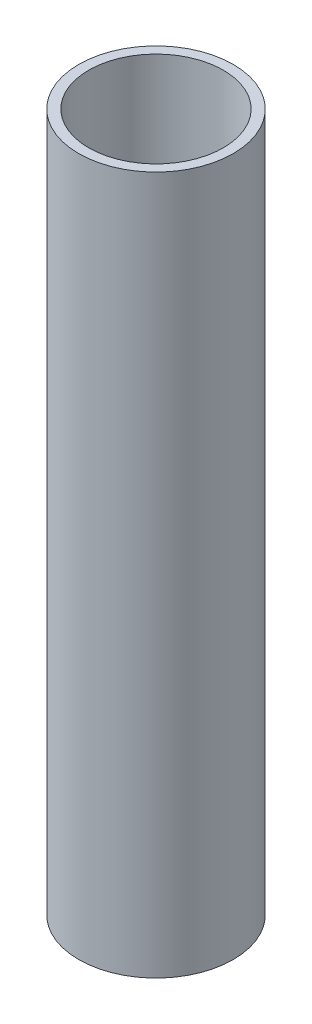
ISO-10303-21;
HEADER;
FILE_DESCRIPTION(('STEP AP214'),'2;1');
FILE_NAME('part.step','',(''),(''),'','','');
FILE_SCHEMA(('AUTOMOTIVE_DESIGN { 1 0 10303 214 1 1 1 1 }'));
ENDSEC;
DATA;
#1=APPLICATION_CONTEXT('core data for automotive mechanical design processes');
#2=APPLICATION_PROTOCOL_DEFINITION('international standard','automotive_design',2000,#1);
#3=PRODUCT_CONTEXT('',#1,'mechanical');
#4=PRODUCT('Part','Part','',(#3));
#5=PRODUCT_RELATED_PRODUCT_CATEGORY('part','',(#4));
#6=PRODUCT_DEFINITION_FORMATION('','',#4);
#7=PRODUCT_DEFINITION_CONTEXT('part definition',#1,'design');
#8=PRODUCT_DEFINITION('design','',#6,#7);
#9=PRODUCT_DEFINITION_SHAPE('','',#8);
#10=(LENGTH_UNIT() NAMED_UNIT(*) SI_UNIT(.MILLI.,.METRE.));
#11=(NAMED_UNIT(*) PLANE_ANGLE_UNIT() SI_UNIT($,.RADIAN.));
#12=(NAMED_UNIT(*) SI_UNIT($,.STERADIAN.) SOLID_ANGLE_UNIT());
#13=UNCERTAINTY_MEASURE_WITH_UNIT(LENGTH_MEASURE(1.E-05),#10,'distance_accuracy_value','');
#14=(GEOMETRIC_REPRESENTATION_CONTEXT(3) GLOBAL_UNCERTAINTY_ASSIGNED_CONTEXT((#13)) GLOBAL_UNIT_ASSIGNED_CONTEXT((#10,
#11,#12)) REPRESENTATION_CONTEXT('',''));
#15=CARTESIAN_POINT('',(0.,0.,0.));
#16=DIRECTION('',(0.,0.,1.));
#17=DIRECTION('',(1.,0.,0.));
#18=AXIS2_PLACEMENT_3D('',#15,#16,#17);
#19=CARTESIAN_POINT('',(0.,140.,0.));
#20=DIRECTION('',(0.,1.,0.));
#21=DIRECTION('',(0.,0.,1.));
#22=AXIS2_PLACEMENT_3D('',#19,#20,#21);
#23=PLANE('',#22);
#24=CARTESIAN_POINT('',(0.,140.,0.));
#25=DIRECTION('',(0.,1.,0.));
#26=DIRECTION('',(0.,0.,1.));
#27=AXIS2_PLACEMENT_3D('',#24,#25,#26);
#28=CIRCLE('',#27,15.5);
#29=CARTESIAN_POINT('',(0.,140.,15.5));
#30=VERTEX_POINT('',#29);
#31=EDGE_CURVE('E10',#30,#30,#28,.T.);
#32=ORIENTED_EDGE('',*,*,#31,.T.);
#33=EDGE_LOOP('',(#32));
#34=FACE_BOUND('',#33,.T.);
#35=CARTESIAN_POINT('',(0.,140.,0.));
#36=DIRECTION('',(0.,1.,0.));
#37=DIRECTION('',(0.,0.,1.));
#38=AXIS2_PLACEMENT_3D('',#35,#36,#37);
#39=CIRCLE('',#38,13.5);
#40=CARTESIAN_POINT('',(0.,140.,13.5));
#41=VERTEX_POINT('',#40);
#42=EDGE_CURVE('E42',#41,#41,#39,.T.);
#43=ORIENTED_EDGE('',*,*,#42,.F.);
#44=EDGE_LOOP('',(#43));
#45=FACE_BOUND('',#44,.T.);
#46=ADVANCED_FACE('F31',(#34,#45),#23,.T.);
#47=CARTESIAN_POINT('',(0.,0.,0.));
#48=DIRECTION('',(0.,1.,0.));
#49=DIRECTION('',(0.,0.,1.));
#50=AXIS2_PLACEMENT_3D('',#47,#48,#49);
#51=PLANE('',#50);
#52=CARTESIAN_POINT('',(0.,0.,0.));
#53=DIRECTION('',(0.,1.,0.));
#54=DIRECTION('',(0.,0.,1.));
#55=AXIS2_PLACEMENT_3D('',#52,#53,#54);
#56=CIRCLE('',#55,15.5);
#57=CARTESIAN_POINT('',(0.,0.,15.5));
#58=VERTEX_POINT('',#57);
#59=EDGE_CURVE('E35',#58,#58,#56,.T.);
#60=ORIENTED_EDGE('',*,*,#59,.F.);
#61=EDGE_LOOP('',(#60));
#62=FACE_BOUND('',#61,.T.);
#63=CARTESIAN_POINT('',(0.,0.,0.));
#64=DIRECTION('',(0.,1.,0.));
#65=DIRECTION('',(0.,0.,1.));
#66=AXIS2_PLACEMENT_3D('',#63,#64,#65);
#67=CIRCLE('',#66,13.5);
#68=CARTESIAN_POINT('',(0.,0.,13.5));
#69=VERTEX_POINT('',#68);
#70=EDGE_CURVE('E44',#69,#69,#67,.T.);
#71=ORIENTED_EDGE('',*,*,#70,.T.);
#72=EDGE_LOOP('',(#71));
#73=FACE_BOUND('',#72,.T.);
#74=ADVANCED_FACE('F54',(#62,#73),#51,.F.);
#75=CARTESIAN_POINT('',(0.,140.,0.));
#76=DIRECTION('',(0.,-1.,0.));
#77=DIRECTION('',(0.,0.,-1.));
#78=AXIS2_PLACEMENT_3D('',#75,#76,#77);
#79=CYLINDRICAL_SURFACE('',#78,15.5);
#80=ORIENTED_EDGE('',*,*,#31,.F.);
#81=EDGE_LOOP('',(#80));
#82=FACE_BOUND('',#81,.T.);
#83=ORIENTED_EDGE('',*,*,#59,.T.);
#84=EDGE_LOOP('',(#83));
#85=FACE_BOUND('',#84,.T.);
#86=ADVANCED_FACE('F33',(#82,#85),#79,.T.);
#87=CARTESIAN_POINT('',(0.,140.,0.));
#88=DIRECTION('',(0.,-1.,0.));
#89=DIRECTION('',(0.,0.,-1.));
#90=AXIS2_PLACEMENT_3D('',#87,#88,#89);
#91=CYLINDRICAL_SURFACE('',#90,13.5);
#92=ORIENTED_EDGE('',*,*,#42,.T.);
#93=EDGE_LOOP('',(#92));
#94=FACE_BOUND('',#93,.T.);
#95=ORIENTED_EDGE('',*,*,#70,.F.);
#96=EDGE_LOOP('',(#95));
#97=FACE_BOUND('',#96,.T.);
#98=ADVANCED_FACE('F50',(#94,#97),#91,.F.);
#99=CLOSED_SHELL('',(#46,#74,#86,#98));
#100=MANIFOLD_SOLID_BREP('B2',#99);
#101=ADVANCED_BREP_SHAPE_REPRESENTATION('',(#18,#100),#14);
#102=SHAPE_DEFINITION_REPRESENTATION(#9,#101);
ENDSEC;
END-ISO-10303-21;
